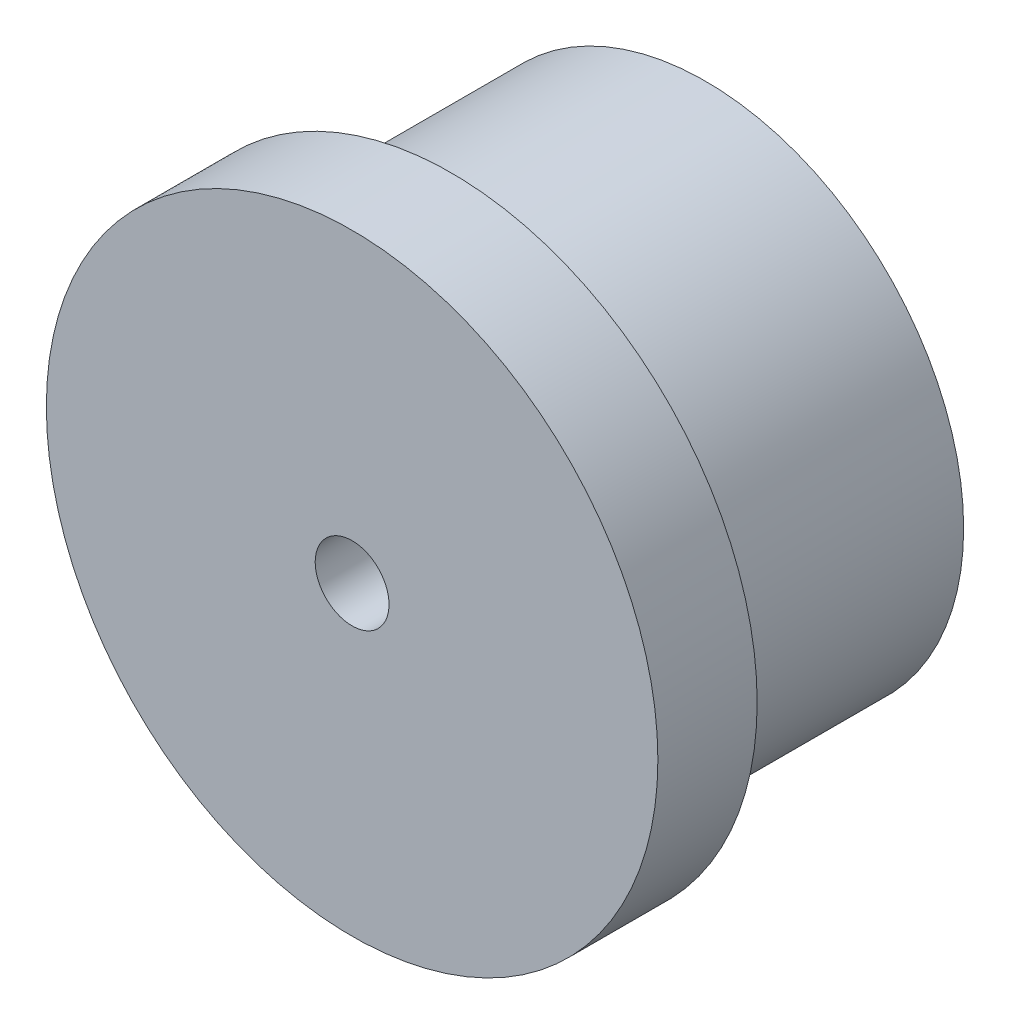
ISO-10303-21;
HEADER;
FILE_DESCRIPTION(('STEP AP214'),'2;1');
FILE_NAME('part.step','',(''),(''),'','','');
FILE_SCHEMA(('AUTOMOTIVE_DESIGN { 1 0 10303 214 1 1 1 1 }'));
ENDSEC;
DATA;
#1=APPLICATION_CONTEXT('core data for automotive mechanical design processes');
#2=APPLICATION_PROTOCOL_DEFINITION('international standard','automotive_design',2000,#1);
#3=PRODUCT_CONTEXT('',#1,'mechanical');
#4=PRODUCT('Part','Part','',(#3));
#5=PRODUCT_RELATED_PRODUCT_CATEGORY('part','',(#4));
#6=PRODUCT_DEFINITION_FORMATION('','',#4);
#7=PRODUCT_DEFINITION_CONTEXT('part definition',#1,'design');
#8=PRODUCT_DEFINITION('design','',#6,#7);
#9=PRODUCT_DEFINITION_SHAPE('','',#8);
#10=(LENGTH_UNIT() NAMED_UNIT(*) SI_UNIT(.MILLI.,.METRE.));
#11=(NAMED_UNIT(*) PLANE_ANGLE_UNIT() SI_UNIT($,.RADIAN.));
#12=(NAMED_UNIT(*) SI_UNIT($,.STERADIAN.) SOLID_ANGLE_UNIT());
#13=UNCERTAINTY_MEASURE_WITH_UNIT(LENGTH_MEASURE(1.E-05),#10,'distance_accuracy_value','');
#14=(GEOMETRIC_REPRESENTATION_CONTEXT(3) GLOBAL_UNCERTAINTY_ASSIGNED_CONTEXT((#13)) GLOBAL_UNIT_ASSIGNED_CONTEXT((#10,
#11,#12)) REPRESENTATION_CONTEXT('',''));
#15=CARTESIAN_POINT('',(0.,0.,0.));
#16=DIRECTION('',(0.,0.,1.));
#17=DIRECTION('',(1.,0.,0.));
#18=AXIS2_PLACEMENT_3D('',#15,#16,#17);
#19=CARTESIAN_POINT('',(6.731,-165.719229699861,-4.06400000000002));
#20=DIRECTION('',(0.,0.,1.));
#21=DIRECTION('',(1.,0.,0.));
#22=AXIS2_PLACEMENT_3D('',#19,#20,#21);
#23=CYLINDRICAL_SURFACE('',#22,4.1275);
#24=CARTESIAN_POINT('',(6.731,-165.719229699861,-4.06400000000002));
#25=DIRECTION('',(0.,0.,1.));
#26=DIRECTION('',(1.,0.,0.));
#27=AXIS2_PLACEMENT_3D('',#24,#25,#26);
#28=CIRCLE('',#27,4.1275);
#29=CARTESIAN_POINT('',(10.8585,-165.719229699861,-4.06400000000002));
#30=VERTEX_POINT('',#29);
#31=EDGE_CURVE('E10',#30,#30,#28,.T.);
#32=ORIENTED_EDGE('',*,*,#31,.T.);
#33=EDGE_LOOP('',(#32));
#34=FACE_BOUND('',#33,.T.);
#35=CARTESIAN_POINT('',(6.731,-165.719229699861,0.));
#36=DIRECTION('',(0.,0.,1.));
#37=DIRECTION('',(1.,0.,0.));
#38=AXIS2_PLACEMENT_3D('',#35,#36,#37);
#39=CIRCLE('',#38,4.1275);
#40=CARTESIAN_POINT('',(10.8585,-165.719229699861,0.));
#41=VERTEX_POINT('',#40);
#42=EDGE_CURVE('E37',#41,#41,#39,.T.);
#43=ORIENTED_EDGE('',*,*,#42,.F.);
#44=EDGE_LOOP('',(#43));
#45=FACE_BOUND('',#44,.T.);
#46=ADVANCED_FACE('F34',(#34,#45),#23,.T.);
#47=CARTESIAN_POINT('',(6.731,-165.719229699861,-4.06400000000002));
#48=DIRECTION('',(0.,0.,1.));
#49=DIRECTION('',(1.,0.,0.));
#50=AXIS2_PLACEMENT_3D('',#47,#48,#49);
#51=PLANE('',#50);
#52=CARTESIAN_POINT('',(6.731,-165.719229699861,-4.06400000000002));
#53=DIRECTION('',(0.,0.,-1.));
#54=DIRECTION('',(-1.,0.,0.));
#55=AXIS2_PLACEMENT_3D('',#52,#53,#54);
#56=CIRCLE('',#55,0.590549999999988);
#57=CARTESIAN_POINT('',(6.14045000000001,-165.719229699861,-4.06400000000002));
#58=VERTEX_POINT('',#57);
#59=EDGE_CURVE('E54',#58,#58,#56,.T.);
#60=ORIENTED_EDGE('',*,*,#59,.F.);
#61=EDGE_LOOP('',(#60));
#62=FACE_BOUND('',#61,.T.);
#63=ORIENTED_EDGE('',*,*,#31,.F.);
#64=EDGE_LOOP('',(#63));
#65=FACE_BOUND('',#64,.T.);
#66=ADVANCED_FACE('F60',(#62,#65),#51,.F.);
#67=CARTESIAN_POINT('',(6.731,-165.719229699861,1.58750000000002));
#68=DIRECTION('',(0.,0.,-1.));
#69=DIRECTION('',(-1.,0.,0.));
#70=AXIS2_PLACEMENT_3D('',#67,#68,#69);
#71=CYLINDRICAL_SURFACE('',#70,4.8895);
#72=CARTESIAN_POINT('',(6.731,-165.719229699861,1.58750000000002));
#73=DIRECTION('',(0.,0.,1.));
#74=DIRECTION('',(1.,0.,0.));
#75=AXIS2_PLACEMENT_3D('',#72,#73,#74);
#76=CIRCLE('',#75,4.8895);
#77=CARTESIAN_POINT('',(11.6205,-165.719229699861,1.58750000000002));
#78=VERTEX_POINT('',#77);
#79=EDGE_CURVE('E44',#78,#78,#76,.T.);
#80=ORIENTED_EDGE('',*,*,#79,.F.);
#81=EDGE_LOOP('',(#80));
#82=FACE_BOUND('',#81,.T.);
#83=CARTESIAN_POINT('',(6.731,-165.719229699861,0.));
#84=DIRECTION('',(0.,0.,1.));
#85=DIRECTION('',(1.,0.,0.));
#86=AXIS2_PLACEMENT_3D('',#83,#84,#85);
#87=CIRCLE('',#86,4.8895);
#88=CARTESIAN_POINT('',(11.6205,-165.719229699861,0.));
#89=VERTEX_POINT('',#88);
#90=EDGE_CURVE('E46',#89,#89,#87,.T.);
#91=ORIENTED_EDGE('',*,*,#90,.T.);
#92=EDGE_LOOP('',(#91));
#93=FACE_BOUND('',#92,.T.);
#94=ADVANCED_FACE('F63',(#82,#93),#71,.T.);
#95=CARTESIAN_POINT('',(6.731,-165.719229699861,1.58750000000002));
#96=DIRECTION('',(0.,0.,1.));
#97=DIRECTION('',(1.,0.,0.));
#98=AXIS2_PLACEMENT_3D('',#95,#96,#97);
#99=PLANE('',#98);
#100=CARTESIAN_POINT('',(6.731,-165.719229699861,1.58750000000002));
#101=DIRECTION('',(0.,0.,-1.));
#102=DIRECTION('',(-1.,0.,0.));
#103=AXIS2_PLACEMENT_3D('',#100,#101,#102);
#104=CIRCLE('',#103,0.590549999999996);
#105=CARTESIAN_POINT('',(6.14045,-165.719229699861,1.58750000000002));
#106=VERTEX_POINT('',#105);
#107=EDGE_CURVE('E49',#106,#106,#104,.T.);
#108=ORIENTED_EDGE('',*,*,#107,.T.);
#109=EDGE_LOOP('',(#108));
#110=FACE_BOUND('',#109,.T.);
#111=ORIENTED_EDGE('',*,*,#79,.T.);
#112=EDGE_LOOP('',(#111));
#113=FACE_BOUND('',#112,.T.);
#114=ADVANCED_FACE('F68',(#110,#113),#99,.T.);
#115=CARTESIAN_POINT('',(6.731,-165.719229699861,0.));
#116=DIRECTION('',(0.,0.,1.));
#117=DIRECTION('',(1.,0.,0.));
#118=AXIS2_PLACEMENT_3D('',#115,#116,#117);
#119=PLANE('',#118);
#120=ORIENTED_EDGE('',*,*,#42,.T.);
#121=EDGE_LOOP('',(#120));
#122=FACE_BOUND('',#121,.T.);
#123=ORIENTED_EDGE('',*,*,#90,.F.);
#124=EDGE_LOOP('',(#123));
#125=FACE_BOUND('',#124,.T.);
#126=ADVANCED_FACE('F72',(#122,#125),#119,.F.);
#127=CARTESIAN_POINT('',(6.731,-165.719229699861,-4.06400000000002));
#128=DIRECTION('',(0.,0.,-1.));
#129=DIRECTION('',(-1.,0.,0.));
#130=AXIS2_PLACEMENT_3D('',#127,#128,#129);
#131=CYLINDRICAL_SURFACE('',#130,0.590549999999992);
#132=ORIENTED_EDGE('',*,*,#107,.F.);
#133=EDGE_LOOP('',(#132));
#134=FACE_BOUND('',#133,.T.);
#135=ORIENTED_EDGE('',*,*,#59,.T.);
#136=EDGE_LOOP('',(#135));
#137=FACE_BOUND('',#136,.T.);
#138=ADVANCED_FACE('F58',(#134,#137),#131,.F.);
#139=CLOSED_SHELL('',(#46,#66,#94,#114,#126,#138));
#140=MANIFOLD_SOLID_BREP('B2',#139);
#141=ADVANCED_BREP_SHAPE_REPRESENTATION('',(#18,#140),#14);
#142=SHAPE_DEFINITION_REPRESENTATION(#9,#141);
ENDSEC;
END-ISO-10303-21;
